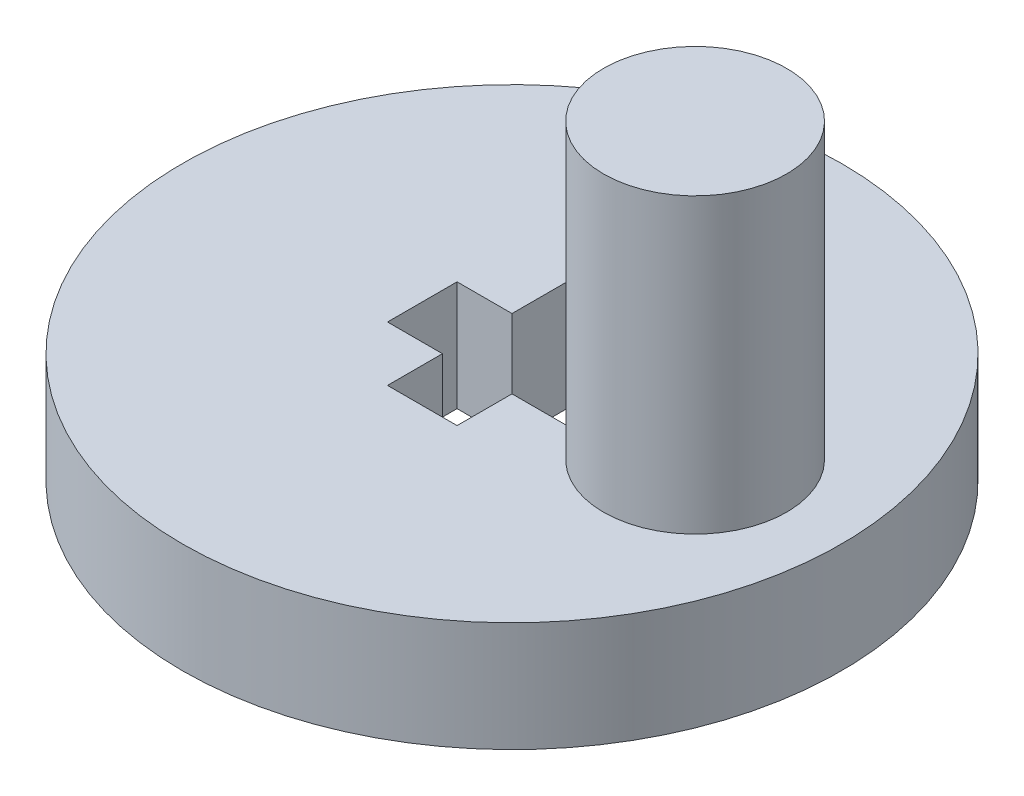
ISO-10303-21;
HEADER;
FILE_DESCRIPTION(('STEP AP214'),'2;1');
FILE_NAME('part.step','',(''),(''),'','','');
FILE_SCHEMA(('AUTOMOTIVE_DESIGN { 1 0 10303 214 1 1 1 1 }'));
ENDSEC;
DATA;
#1=APPLICATION_CONTEXT('core data for automotive mechanical design processes');
#2=APPLICATION_PROTOCOL_DEFINITION('international standard','automotive_design',2000,#1);
#3=PRODUCT_CONTEXT('',#1,'mechanical');
#4=PRODUCT('Part','Part','',(#3));
#5=PRODUCT_RELATED_PRODUCT_CATEGORY('part','',(#4));
#6=PRODUCT_DEFINITION_FORMATION('','',#4);
#7=PRODUCT_DEFINITION_CONTEXT('part definition',#1,'design');
#8=PRODUCT_DEFINITION('design','',#6,#7);
#9=PRODUCT_DEFINITION_SHAPE('','',#8);
#10=(LENGTH_UNIT() NAMED_UNIT(*) SI_UNIT(.MILLI.,.METRE.));
#11=(NAMED_UNIT(*) PLANE_ANGLE_UNIT() SI_UNIT($,.RADIAN.));
#12=(NAMED_UNIT(*) SI_UNIT($,.STERADIAN.) SOLID_ANGLE_UNIT());
#13=UNCERTAINTY_MEASURE_WITH_UNIT(LENGTH_MEASURE(1.E-05),#10,'distance_accuracy_value','');
#14=(GEOMETRIC_REPRESENTATION_CONTEXT(3) GLOBAL_UNCERTAINTY_ASSIGNED_CONTEXT((#13)) GLOBAL_UNIT_ASSIGNED_CONTEXT((#10,
#11,#12)) REPRESENTATION_CONTEXT('',''));
#15=CARTESIAN_POINT('',(0.,0.,0.));
#16=DIRECTION('',(0.,0.,1.));
#17=DIRECTION('',(1.,0.,0.));
#18=AXIS2_PLACEMENT_3D('',#15,#16,#17);
#19=CARTESIAN_POINT('',(0.,3.,0.));
#20=DIRECTION('',(0.,1.,0.));
#21=DIRECTION('',(0.,0.,1.));
#22=AXIS2_PLACEMENT_3D('',#19,#20,#21);
#23=PLANE('',#22);
#24=CARTESIAN_POINT('',(5.,3.,0.));
#25=DIRECTION('',(0.,1.,0.));
#26=DIRECTION('',(0.,0.,1.));
#27=AXIS2_PLACEMENT_3D('',#24,#25,#26);
#28=CIRCLE('',#27,2.5);
#29=CARTESIAN_POINT('',(5.,3.,2.5));
#30=VERTEX_POINT('',#29);
#31=EDGE_CURVE('E390',#30,#30,#28,.T.);
#32=ORIENTED_EDGE('',*,*,#31,.F.);
#33=EDGE_LOOP('',(#32));
#34=FACE_BOUND('',#33,.T.);
#35=CARTESIAN_POINT('',(0.,3.,0.));
#36=DIRECTION('',(0.,1.,0.));
#37=DIRECTION('',(0.,0.,1.));
#38=AXIS2_PLACEMENT_3D('',#35,#36,#37);
#39=CIRCLE('',#38,9.);
#40=CARTESIAN_POINT('',(0.,3.,9.));
#41=VERTEX_POINT('',#40);
#42=EDGE_CURVE('E11',#41,#41,#39,.T.);
#43=ORIENTED_EDGE('',*,*,#42,.T.);
#44=EDGE_LOOP('',(#43));
#45=FACE_BOUND('',#44,.T.);
#46=DIRECTION('',(0.,0.,1.));
#47=VECTOR('',#46,1.);
#48=CARTESIAN_POINT('',(-2.45,3.,-0.95));
#49=LINE('',#48,#47);
#50=CARTESIAN_POINT('',(-2.45,3.,-0.95));
#51=VERTEX_POINT('',#50);
#52=CARTESIAN_POINT('',(-2.45,3.,0.95));
#53=VERTEX_POINT('',#52);
#54=EDGE_CURVE('E137',#51,#53,#49,.T.);
#55=ORIENTED_EDGE('',*,*,#54,.F.);
#56=DIRECTION('',(-1.,0.,0.));
#57=VECTOR('',#56,1.);
#58=CARTESIAN_POINT('',(-0.95,3.,-0.95));
#59=LINE('',#58,#57);
#60=CARTESIAN_POINT('',(-0.95,3.,-0.95));
#61=VERTEX_POINT('',#60);
#62=EDGE_CURVE('E129',#61,#51,#59,.T.);
#63=ORIENTED_EDGE('',*,*,#62,.F.);
#64=DIRECTION('',(0.,0.,1.));
#65=VECTOR('',#64,1.);
#66=CARTESIAN_POINT('',(-0.95,3.,-2.45));
#67=LINE('',#66,#65);
#68=CARTESIAN_POINT('',(-0.95,3.,-2.45));
#69=VERTEX_POINT('',#68);
#70=EDGE_CURVE('E170',#69,#61,#67,.T.);
#71=ORIENTED_EDGE('',*,*,#70,.F.);
#72=DIRECTION('',(-1.,0.,0.));
#73=VECTOR('',#72,1.);
#74=CARTESIAN_POINT('',(0.95,3.,-2.45));
#75=LINE('',#74,#73);
#76=CARTESIAN_POINT('',(0.95,3.,-2.45));
#77=VERTEX_POINT('',#76);
#78=EDGE_CURVE('E168',#77,#69,#75,.T.);
#79=ORIENTED_EDGE('',*,*,#78,.F.);
#80=DIRECTION('',(0.,0.,-1.));
#81=VECTOR('',#80,1.);
#82=CARTESIAN_POINT('',(0.95,3.,-0.95));
#83=LINE('',#82,#81);
#84=CARTESIAN_POINT('',(0.95,3.,-0.95));
#85=VERTEX_POINT('',#84);
#86=EDGE_CURVE('E166',#85,#77,#83,.T.);
#87=ORIENTED_EDGE('',*,*,#86,.F.);
#88=DIRECTION('',(-1.,0.,0.));
#89=VECTOR('',#88,1.);
#90=CARTESIAN_POINT('',(2.45,3.,-0.95));
#91=LINE('',#90,#89);
#92=CARTESIAN_POINT('',(2.45,3.,-0.95));
#93=VERTEX_POINT('',#92);
#94=EDGE_CURVE('E164',#93,#85,#91,.T.);
#95=ORIENTED_EDGE('',*,*,#94,.F.);
#96=DIRECTION('',(0.,0.,-1.));
#97=VECTOR('',#96,1.);
#98=CARTESIAN_POINT('',(2.45,3.,0.95));
#99=LINE('',#98,#97);
#100=CARTESIAN_POINT('',(2.45,3.,0.95));
#101=VERTEX_POINT('',#100);
#102=EDGE_CURVE('E162',#101,#93,#99,.T.);
#103=ORIENTED_EDGE('',*,*,#102,.F.);
#104=DIRECTION('',(1.,0.,0.));
#105=VECTOR('',#104,1.);
#106=CARTESIAN_POINT('',(0.95,3.,0.95));
#107=LINE('',#106,#105);
#108=CARTESIAN_POINT('',(0.95,3.,0.95));
#109=VERTEX_POINT('',#108);
#110=EDGE_CURVE('E160',#109,#101,#107,.T.);
#111=ORIENTED_EDGE('',*,*,#110,.F.);
#112=DIRECTION('',(0.,0.,-1.));
#113=VECTOR('',#112,1.);
#114=CARTESIAN_POINT('',(0.95,3.,2.45));
#115=LINE('',#114,#113);
#116=CARTESIAN_POINT('',(0.95,3.,2.45));
#117=VERTEX_POINT('',#116);
#118=EDGE_CURVE('E158',#117,#109,#115,.T.);
#119=ORIENTED_EDGE('',*,*,#118,.F.);
#120=DIRECTION('',(1.,0.,0.));
#121=VECTOR('',#120,1.);
#122=CARTESIAN_POINT('',(-0.95,3.,2.45));
#123=LINE('',#122,#121);
#124=CARTESIAN_POINT('',(-0.95,3.,2.45));
#125=VERTEX_POINT('',#124);
#126=EDGE_CURVE('E156',#125,#117,#123,.T.);
#127=ORIENTED_EDGE('',*,*,#126,.F.);
#128=DIRECTION('',(0.,0.,1.));
#129=VECTOR('',#128,1.);
#130=CARTESIAN_POINT('',(-0.95,3.,0.95));
#131=LINE('',#130,#129);
#132=CARTESIAN_POINT('',(-0.95,3.,0.95));
#133=VERTEX_POINT('',#132);
#134=EDGE_CURVE('E151',#133,#125,#131,.T.);
#135=ORIENTED_EDGE('',*,*,#134,.F.);
#136=DIRECTION('',(1.,0.,0.));
#137=VECTOR('',#136,1.);
#138=CARTESIAN_POINT('',(-2.45,3.,0.95));
#139=LINE('',#138,#137);
#140=EDGE_CURVE('E149',#53,#133,#139,.T.);
#141=ORIENTED_EDGE('',*,*,#140,.F.);
#142=EDGE_LOOP('',(#55,#63,#71,#79,#87,#95,#103,#111,#119,#127,#135,#141));
#143=FACE_BOUND('',#142,.T.);
#144=ADVANCED_FACE('F40',(#34,#45,#143),#23,.T.);
#145=CARTESIAN_POINT('',(0.,0.,0.));
#146=DIRECTION('',(0.,1.,0.));
#147=DIRECTION('',(0.,0.,1.));
#148=AXIS2_PLACEMENT_3D('',#145,#146,#147);
#149=PLANE('',#148);
#150=CARTESIAN_POINT('',(0.,0.,0.));
#151=DIRECTION('',(0.,1.,0.));
#152=DIRECTION('',(0.,0.,1.));
#153=AXIS2_PLACEMENT_3D('',#150,#151,#152);
#154=CIRCLE('',#153,9.);
#155=CARTESIAN_POINT('',(0.,0.,9.));
#156=VERTEX_POINT('',#155);
#157=EDGE_CURVE('E44',#156,#156,#154,.T.);
#158=ORIENTED_EDGE('',*,*,#157,.F.);
#159=EDGE_LOOP('',(#158));
#160=FACE_BOUND('',#159,.T.);
#161=DIRECTION('',(-1.,0.,0.));
#162=VECTOR('',#161,1.);
#163=CARTESIAN_POINT('',(-0.95,0.,-0.95));
#164=LINE('',#163,#162);
#165=CARTESIAN_POINT('',(-0.95,0.,-0.95));
#166=VERTEX_POINT('',#165);
#167=CARTESIAN_POINT('',(-2.45,0.,-0.95));
#168=VERTEX_POINT('',#167);
#169=EDGE_CURVE('E63',#166,#168,#164,.T.);
#170=ORIENTED_EDGE('',*,*,#169,.T.);
#171=DIRECTION('',(0.,0.,1.));
#172=VECTOR('',#171,1.);
#173=CARTESIAN_POINT('',(-2.45,0.,-0.95));
#174=LINE('',#173,#172);
#175=CARTESIAN_POINT('',(-2.45,0.,0.95));
#176=VERTEX_POINT('',#175);
#177=EDGE_CURVE('E144',#168,#176,#174,.T.);
#178=ORIENTED_EDGE('',*,*,#177,.T.);
#179=DIRECTION('',(1.,0.,0.));
#180=VECTOR('',#179,1.);
#181=CARTESIAN_POINT('',(-2.45,0.,0.95));
#182=LINE('',#181,#180);
#183=CARTESIAN_POINT('',(-0.95,0.,0.95));
#184=VERTEX_POINT('',#183);
#185=EDGE_CURVE('E175',#176,#184,#182,.T.);
#186=ORIENTED_EDGE('',*,*,#185,.T.);
#187=DIRECTION('',(0.,0.,1.));
#188=VECTOR('',#187,1.);
#189=CARTESIAN_POINT('',(-0.95,0.,0.95));
#190=LINE('',#189,#188);
#191=CARTESIAN_POINT('',(-0.95,0.,2.45));
#192=VERTEX_POINT('',#191);
#193=EDGE_CURVE('E178',#184,#192,#190,.T.);
#194=ORIENTED_EDGE('',*,*,#193,.T.);
#195=DIRECTION('',(1.,0.,0.));
#196=VECTOR('',#195,1.);
#197=CARTESIAN_POINT('',(-0.95,0.,2.45));
#198=LINE('',#197,#196);
#199=CARTESIAN_POINT('',(0.95,0.,2.45));
#200=VERTEX_POINT('',#199);
#201=EDGE_CURVE('E181',#192,#200,#198,.T.);
#202=ORIENTED_EDGE('',*,*,#201,.T.);
#203=DIRECTION('',(0.,0.,-1.));
#204=VECTOR('',#203,1.);
#205=CARTESIAN_POINT('',(0.95,0.,2.45));
#206=LINE('',#205,#204);
#207=CARTESIAN_POINT('',(0.95,0.,0.95));
#208=VERTEX_POINT('',#207);
#209=EDGE_CURVE('E184',#200,#208,#206,.T.);
#210=ORIENTED_EDGE('',*,*,#209,.T.);
#211=DIRECTION('',(1.,0.,0.));
#212=VECTOR('',#211,1.);
#213=CARTESIAN_POINT('',(0.95,0.,0.95));
#214=LINE('',#213,#212);
#215=CARTESIAN_POINT('',(2.45,0.,0.95));
#216=VERTEX_POINT('',#215);
#217=EDGE_CURVE('E187',#208,#216,#214,.T.);
#218=ORIENTED_EDGE('',*,*,#217,.T.);
#219=DIRECTION('',(0.,0.,-1.));
#220=VECTOR('',#219,1.);
#221=CARTESIAN_POINT('',(2.45,0.,0.95));
#222=LINE('',#221,#220);
#223=CARTESIAN_POINT('',(2.45,0.,-0.95));
#224=VERTEX_POINT('',#223);
#225=EDGE_CURVE('E190',#216,#224,#222,.T.);
#226=ORIENTED_EDGE('',*,*,#225,.T.);
#227=DIRECTION('',(-1.,0.,0.));
#228=VECTOR('',#227,1.);
#229=CARTESIAN_POINT('',(2.45,0.,-0.95));
#230=LINE('',#229,#228);
#231=CARTESIAN_POINT('',(0.95,0.,-0.95));
#232=VERTEX_POINT('',#231);
#233=EDGE_CURVE('E193',#224,#232,#230,.T.);
#234=ORIENTED_EDGE('',*,*,#233,.T.);
#235=DIRECTION('',(0.,0.,-1.));
#236=VECTOR('',#235,1.);
#237=CARTESIAN_POINT('',(0.95,0.,-0.95));
#238=LINE('',#237,#236);
#239=CARTESIAN_POINT('',(0.95,0.,-2.45));
#240=VERTEX_POINT('',#239);
#241=EDGE_CURVE('E196',#232,#240,#238,.T.);
#242=ORIENTED_EDGE('',*,*,#241,.T.);
#243=DIRECTION('',(-1.,0.,0.));
#244=VECTOR('',#243,1.);
#245=CARTESIAN_POINT('',(0.95,0.,-2.45));
#246=LINE('',#245,#244);
#247=CARTESIAN_POINT('',(-0.95,0.,-2.45));
#248=VERTEX_POINT('',#247);
#249=EDGE_CURVE('E199',#240,#248,#246,.T.);
#250=ORIENTED_EDGE('',*,*,#249,.T.);
#251=DIRECTION('',(0.,0.,1.));
#252=VECTOR('',#251,1.);
#253=CARTESIAN_POINT('',(-0.95,0.,-2.45));
#254=LINE('',#253,#252);
#255=EDGE_CURVE('E138',#248,#166,#254,.T.);
#256=ORIENTED_EDGE('',*,*,#255,.T.);
#257=EDGE_LOOP('',(#170,#178,#186,#194,#202,#210,#218,#226,#234,#242,#250,#256));
#258=FACE_BOUND('',#257,.T.);
#259=ADVANCED_FACE('F228',(#160,#258),#149,.F.);
#260=CARTESIAN_POINT('',(0.,3.,0.));
#261=DIRECTION('',(0.,-1.,0.));
#262=DIRECTION('',(0.,0.,-1.));
#263=AXIS2_PLACEMENT_3D('',#260,#261,#262);
#264=CYLINDRICAL_SURFACE('',#263,9.);
#265=ORIENTED_EDGE('',*,*,#42,.F.);
#266=EDGE_LOOP('',(#265));
#267=FACE_BOUND('',#266,.T.);
#268=ORIENTED_EDGE('',*,*,#157,.T.);
#269=EDGE_LOOP('',(#268));
#270=FACE_BOUND('',#269,.T.);
#271=ADVANCED_FACE('F42',(#267,#270),#264,.T.);
#272=CARTESIAN_POINT('',(-0.95,3.,-0.95));
#273=DIRECTION('',(0.,0.,1.));
#274=DIRECTION('',(1.,0.,0.));
#275=AXIS2_PLACEMENT_3D('',#272,#273,#274);
#276=PLANE('',#275);
#277=ORIENTED_EDGE('',*,*,#169,.F.);
#278=DIRECTION('',(0.,-1.,0.));
#279=VECTOR('',#278,1.);
#280=CARTESIAN_POINT('',(-0.95,3.,-0.95));
#281=LINE('',#280,#279);
#282=EDGE_CURVE('E133',#61,#166,#281,.T.);
#283=ORIENTED_EDGE('',*,*,#282,.F.);
#284=ORIENTED_EDGE('',*,*,#62,.T.);
#285=DIRECTION('',(0.,-1.,0.));
#286=VECTOR('',#285,1.);
#287=CARTESIAN_POINT('',(-2.45,3.,-0.95));
#288=LINE('',#287,#286);
#289=EDGE_CURVE('E132',#51,#168,#288,.T.);
#290=ORIENTED_EDGE('',*,*,#289,.T.);
#291=EDGE_LOOP('',(#277,#283,#284,#290));
#292=FACE_BOUND('',#291,.T.);
#293=ADVANCED_FACE('F131',(#292),#276,.T.);
#294=CARTESIAN_POINT('',(-2.45,3.,-0.95));
#295=DIRECTION('',(1.,0.,0.));
#296=DIRECTION('',(0.,0.,-1.));
#297=AXIS2_PLACEMENT_3D('',#294,#295,#296);
#298=PLANE('',#297);
#299=ORIENTED_EDGE('',*,*,#177,.F.);
#300=ORIENTED_EDGE('',*,*,#289,.F.);
#301=ORIENTED_EDGE('',*,*,#54,.T.);
#302=DIRECTION('',(0.,-1.,0.));
#303=VECTOR('',#302,1.);
#304=CARTESIAN_POINT('',(-2.45,3.,0.95));
#305=LINE('',#304,#303);
#306=EDGE_CURVE('E145',#53,#176,#305,.T.);
#307=ORIENTED_EDGE('',*,*,#306,.T.);
#308=EDGE_LOOP('',(#299,#300,#301,#307));
#309=FACE_BOUND('',#308,.T.);
#310=ADVANCED_FACE('F141',(#309),#298,.T.);
#311=CARTESIAN_POINT('',(-2.45,3.,0.95));
#312=DIRECTION('',(0.,0.,-1.));
#313=DIRECTION('',(-1.,0.,0.));
#314=AXIS2_PLACEMENT_3D('',#311,#312,#313);
#315=PLANE('',#314);
#316=ORIENTED_EDGE('',*,*,#185,.F.);
#317=ORIENTED_EDGE('',*,*,#306,.F.);
#318=ORIENTED_EDGE('',*,*,#140,.T.);
#319=DIRECTION('',(0.,-1.,0.));
#320=VECTOR('',#319,1.);
#321=CARTESIAN_POINT('',(-0.95,3.,0.95));
#322=LINE('',#321,#320);
#323=EDGE_CURVE('E220',#133,#184,#322,.T.);
#324=ORIENTED_EDGE('',*,*,#323,.T.);
#325=EDGE_LOOP('',(#316,#317,#318,#324));
#326=FACE_BOUND('',#325,.T.);
#327=ADVANCED_FACE('F224',(#326),#315,.T.);
#328=CARTESIAN_POINT('',(-0.95,3.,0.95));
#329=DIRECTION('',(1.,0.,0.));
#330=DIRECTION('',(0.,0.,-1.));
#331=AXIS2_PLACEMENT_3D('',#328,#329,#330);
#332=PLANE('',#331);
#333=ORIENTED_EDGE('',*,*,#193,.F.);
#334=ORIENTED_EDGE('',*,*,#323,.F.);
#335=ORIENTED_EDGE('',*,*,#134,.T.);
#336=DIRECTION('',(0.,-1.,0.));
#337=VECTOR('',#336,1.);
#338=CARTESIAN_POINT('',(-0.95,3.,2.45));
#339=LINE('',#338,#337);
#340=EDGE_CURVE('E218',#125,#192,#339,.T.);
#341=ORIENTED_EDGE('',*,*,#340,.T.);
#342=EDGE_LOOP('',(#333,#334,#335,#341));
#343=FACE_BOUND('',#342,.T.);
#344=ADVANCED_FACE('F266',(#343),#332,.T.);
#345=CARTESIAN_POINT('',(-0.95,3.,2.45));
#346=DIRECTION('',(0.,0.,-1.));
#347=DIRECTION('',(-1.,0.,0.));
#348=AXIS2_PLACEMENT_3D('',#345,#346,#347);
#349=PLANE('',#348);
#350=ORIENTED_EDGE('',*,*,#201,.F.);
#351=ORIENTED_EDGE('',*,*,#340,.F.);
#352=ORIENTED_EDGE('',*,*,#126,.T.);
#353=DIRECTION('',(0.,-1.,0.));
#354=VECTOR('',#353,1.);
#355=CARTESIAN_POINT('',(0.95,3.,2.45));
#356=LINE('',#355,#354);
#357=EDGE_CURVE('E216',#117,#200,#356,.T.);
#358=ORIENTED_EDGE('',*,*,#357,.T.);
#359=EDGE_LOOP('',(#350,#351,#352,#358));
#360=FACE_BOUND('',#359,.T.);
#361=ADVANCED_FACE('F264',(#360),#349,.T.);
#362=CARTESIAN_POINT('',(0.95,3.,2.45));
#363=DIRECTION('',(-1.,0.,0.));
#364=DIRECTION('',(0.,0.,1.));
#365=AXIS2_PLACEMENT_3D('',#362,#363,#364);
#366=PLANE('',#365);
#367=ORIENTED_EDGE('',*,*,#209,.F.);
#368=ORIENTED_EDGE('',*,*,#357,.F.);
#369=ORIENTED_EDGE('',*,*,#118,.T.);
#370=DIRECTION('',(0.,-1.,0.));
#371=VECTOR('',#370,1.);
#372=CARTESIAN_POINT('',(0.95,3.,0.95));
#373=LINE('',#372,#371);
#374=EDGE_CURVE('E214',#109,#208,#373,.T.);
#375=ORIENTED_EDGE('',*,*,#374,.T.);
#376=EDGE_LOOP('',(#367,#368,#369,#375));
#377=FACE_BOUND('',#376,.T.);
#378=ADVANCED_FACE('F258',(#377),#366,.T.);
#379=CARTESIAN_POINT('',(0.95,3.,0.95));
#380=DIRECTION('',(0.,0.,-1.));
#381=DIRECTION('',(-1.,0.,0.));
#382=AXIS2_PLACEMENT_3D('',#379,#380,#381);
#383=PLANE('',#382);
#384=ORIENTED_EDGE('',*,*,#217,.F.);
#385=ORIENTED_EDGE('',*,*,#374,.F.);
#386=ORIENTED_EDGE('',*,*,#110,.T.);
#387=DIRECTION('',(0.,-1.,0.));
#388=VECTOR('',#387,1.);
#389=CARTESIAN_POINT('',(2.45,3.,0.95));
#390=LINE('',#389,#388);
#391=EDGE_CURVE('E212',#101,#216,#390,.T.);
#392=ORIENTED_EDGE('',*,*,#391,.T.);
#393=EDGE_LOOP('',(#384,#385,#386,#392));
#394=FACE_BOUND('',#393,.T.);
#395=ADVANCED_FACE('F254',(#394),#383,.T.);
#396=CARTESIAN_POINT('',(2.45,3.,0.95));
#397=DIRECTION('',(-1.,0.,0.));
#398=DIRECTION('',(0.,0.,1.));
#399=AXIS2_PLACEMENT_3D('',#396,#397,#398);
#400=PLANE('',#399);
#401=ORIENTED_EDGE('',*,*,#225,.F.);
#402=ORIENTED_EDGE('',*,*,#391,.F.);
#403=ORIENTED_EDGE('',*,*,#102,.T.);
#404=DIRECTION('',(0.,-1.,0.));
#405=VECTOR('',#404,1.);
#406=CARTESIAN_POINT('',(2.45,3.,-0.95));
#407=LINE('',#406,#405);
#408=EDGE_CURVE('E210',#93,#224,#407,.T.);
#409=ORIENTED_EDGE('',*,*,#408,.T.);
#410=EDGE_LOOP('',(#401,#402,#403,#409));
#411=FACE_BOUND('',#410,.T.);
#412=ADVANCED_FACE('F251',(#411),#400,.T.);
#413=CARTESIAN_POINT('',(2.45,3.,-0.95));
#414=DIRECTION('',(0.,0.,1.));
#415=DIRECTION('',(1.,0.,0.));
#416=AXIS2_PLACEMENT_3D('',#413,#414,#415);
#417=PLANE('',#416);
#418=ORIENTED_EDGE('',*,*,#233,.F.);
#419=ORIENTED_EDGE('',*,*,#408,.F.);
#420=ORIENTED_EDGE('',*,*,#94,.T.);
#421=DIRECTION('',(0.,-1.,0.));
#422=VECTOR('',#421,1.);
#423=CARTESIAN_POINT('',(0.95,3.,-0.95));
#424=LINE('',#423,#422);
#425=EDGE_CURVE('E208',#85,#232,#424,.T.);
#426=ORIENTED_EDGE('',*,*,#425,.T.);
#427=EDGE_LOOP('',(#418,#419,#420,#426));
#428=FACE_BOUND('',#427,.T.);
#429=ADVANCED_FACE('F243',(#428),#417,.T.);
#430=CARTESIAN_POINT('',(0.95,3.,-0.95));
#431=DIRECTION('',(-1.,0.,0.));
#432=DIRECTION('',(0.,0.,1.));
#433=AXIS2_PLACEMENT_3D('',#430,#431,#432);
#434=PLANE('',#433);
#435=ORIENTED_EDGE('',*,*,#241,.F.);
#436=ORIENTED_EDGE('',*,*,#425,.F.);
#437=ORIENTED_EDGE('',*,*,#86,.T.);
#438=DIRECTION('',(0.,-1.,0.));
#439=VECTOR('',#438,1.);
#440=CARTESIAN_POINT('',(0.95,3.,-2.45));
#441=LINE('',#440,#439);
#442=EDGE_CURVE('E206',#77,#240,#441,.T.);
#443=ORIENTED_EDGE('',*,*,#442,.T.);
#444=EDGE_LOOP('',(#435,#436,#437,#443));
#445=FACE_BOUND('',#444,.T.);
#446=ADVANCED_FACE('F239',(#445),#434,.T.);
#447=CARTESIAN_POINT('',(0.95,3.,-2.45));
#448=DIRECTION('',(0.,0.,1.));
#449=DIRECTION('',(1.,0.,0.));
#450=AXIS2_PLACEMENT_3D('',#447,#448,#449);
#451=PLANE('',#450);
#452=ORIENTED_EDGE('',*,*,#249,.F.);
#453=ORIENTED_EDGE('',*,*,#442,.F.);
#454=ORIENTED_EDGE('',*,*,#78,.T.);
#455=DIRECTION('',(0.,-1.,0.));
#456=VECTOR('',#455,1.);
#457=CARTESIAN_POINT('',(-0.95,3.,-2.45));
#458=LINE('',#457,#456);
#459=EDGE_CURVE('E55',#69,#248,#458,.T.);
#460=ORIENTED_EDGE('',*,*,#459,.T.);
#461=EDGE_LOOP('',(#452,#453,#454,#460));
#462=FACE_BOUND('',#461,.T.);
#463=ADVANCED_FACE('F236',(#462),#451,.T.);
#464=CARTESIAN_POINT('',(-0.95,3.,-2.45));
#465=DIRECTION('',(1.,0.,0.));
#466=DIRECTION('',(0.,0.,-1.));
#467=AXIS2_PLACEMENT_3D('',#464,#465,#466);
#468=PLANE('',#467);
#469=ORIENTED_EDGE('',*,*,#255,.F.);
#470=ORIENTED_EDGE('',*,*,#459,.F.);
#471=ORIENTED_EDGE('',*,*,#70,.T.);
#472=ORIENTED_EDGE('',*,*,#282,.T.);
#473=EDGE_LOOP('',(#469,#470,#471,#472));
#474=FACE_BOUND('',#473,.T.);
#475=ADVANCED_FACE('F230',(#474),#468,.T.);
#476=CARTESIAN_POINT('',(5.,11.,0.));
#477=DIRECTION('',(0.,-1.,0.));
#478=DIRECTION('',(0.,0.,-1.));
#479=AXIS2_PLACEMENT_3D('',#476,#477,#478);
#480=CYLINDRICAL_SURFACE('',#479,2.5);
#481=CARTESIAN_POINT('',(5.,11.,0.));
#482=DIRECTION('',(0.,1.,0.));
#483=DIRECTION('',(0.,0.,1.));
#484=AXIS2_PLACEMENT_3D('',#481,#482,#483);
#485=CIRCLE('',#484,2.5);
#486=CARTESIAN_POINT('',(5.,11.,2.5));
#487=VERTEX_POINT('',#486);
#488=EDGE_CURVE('E173',#487,#487,#485,.T.);
#489=ORIENTED_EDGE('',*,*,#488,.F.);
#490=EDGE_LOOP('',(#489));
#491=FACE_BOUND('',#490,.T.);
#492=ORIENTED_EDGE('',*,*,#31,.T.);
#493=EDGE_LOOP('',(#492));
#494=FACE_BOUND('',#493,.T.);
#495=ADVANCED_FACE('F367',(#491,#494),#480,.T.);
#496=CARTESIAN_POINT('',(5.,11.,0.));
#497=DIRECTION('',(0.,1.,0.));
#498=DIRECTION('',(0.,0.,1.));
#499=AXIS2_PLACEMENT_3D('',#496,#497,#498);
#500=PLANE('',#499);
#501=ORIENTED_EDGE('',*,*,#488,.T.);
#502=EDGE_LOOP('',(#501));
#503=FACE_BOUND('',#502,.T.);
#504=ADVANCED_FACE('F375',(#503),#500,.T.);
#505=CLOSED_SHELL('',(#144,#259,#271,#293,#310,#327,#344,#361,#378,#395,#412,#429,#446,#463,
#475,#495,#504));
#506=MANIFOLD_SOLID_BREP('B2',#505);
#507=ADVANCED_BREP_SHAPE_REPRESENTATION('',(#18,#506),#14);
#508=SHAPE_DEFINITION_REPRESENTATION(#9,#507);
ENDSEC;
END-ISO-10303-21;
